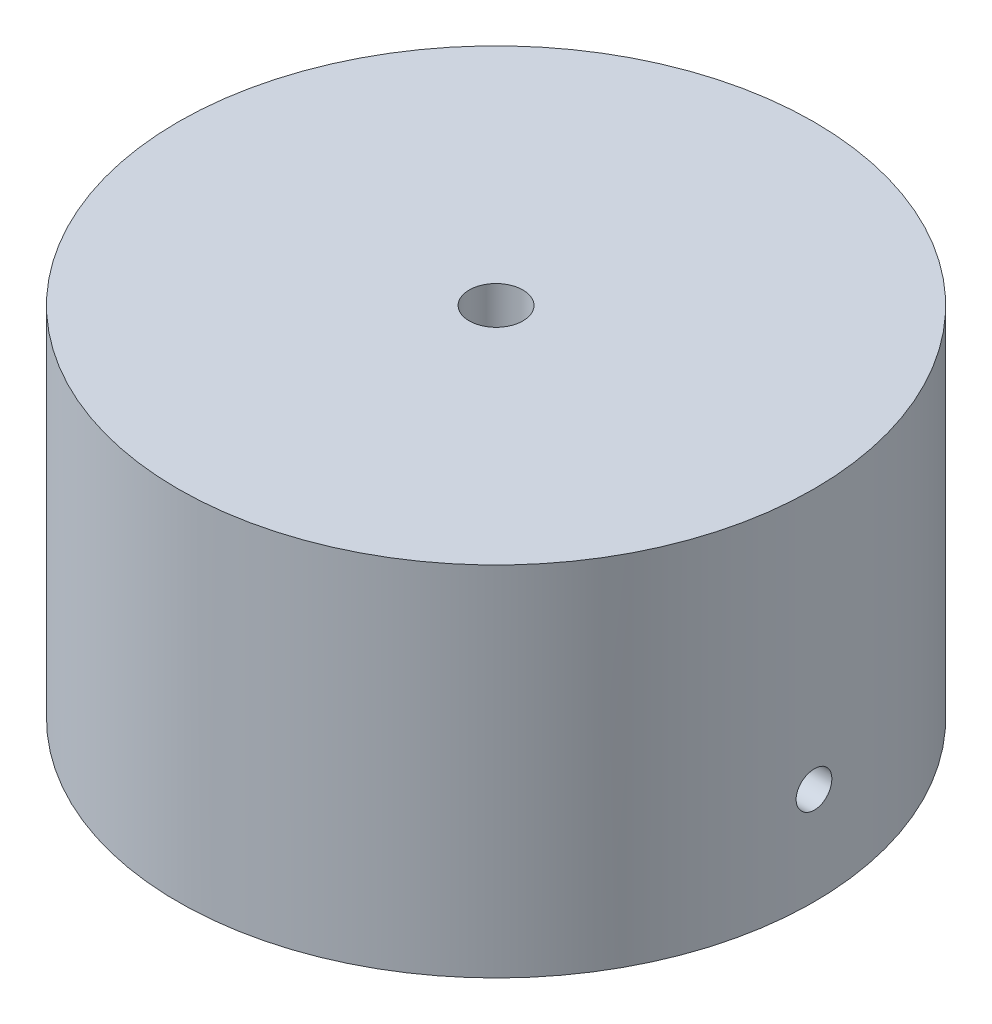
ISO-10303-21;
HEADER;
FILE_DESCRIPTION(('STEP AP214'),'2;1');
FILE_NAME('part.step','',(''),(''),'','','');
FILE_SCHEMA(('AUTOMOTIVE_DESIGN { 1 0 10303 214 1 1 1 1 }'));
ENDSEC;
DATA;
#1=APPLICATION_CONTEXT('core data for automotive mechanical design processes');
#2=APPLICATION_PROTOCOL_DEFINITION('international standard','automotive_design',2000,#1);
#3=PRODUCT_CONTEXT('',#1,'mechanical');
#4=PRODUCT('Part','Part','',(#3));
#5=PRODUCT_RELATED_PRODUCT_CATEGORY('part','',(#4));
#6=PRODUCT_DEFINITION_FORMATION('','',#4);
#7=PRODUCT_DEFINITION_CONTEXT('part definition',#1,'design');
#8=PRODUCT_DEFINITION('design','',#6,#7);
#9=PRODUCT_DEFINITION_SHAPE('','',#8);
#10=(LENGTH_UNIT() NAMED_UNIT(*) SI_UNIT(.MILLI.,.METRE.));
#11=(NAMED_UNIT(*) PLANE_ANGLE_UNIT() SI_UNIT($,.RADIAN.));
#12=(NAMED_UNIT(*) SI_UNIT($,.STERADIAN.) SOLID_ANGLE_UNIT());
#13=UNCERTAINTY_MEASURE_WITH_UNIT(LENGTH_MEASURE(1.E-05),#10,'distance_accuracy_value','');
#14=(GEOMETRIC_REPRESENTATION_CONTEXT(3) GLOBAL_UNCERTAINTY_ASSIGNED_CONTEXT((#13)) GLOBAL_UNIT_ASSIGNED_CONTEXT((#10,
#11,#12)) REPRESENTATION_CONTEXT('',''));
#15=CARTESIAN_POINT('',(0.,0.,0.));
#16=DIRECTION('',(0.,0.,1.));
#17=DIRECTION('',(1.,0.,0.));
#18=AXIS2_PLACEMENT_3D('',#15,#16,#17);
#19=CARTESIAN_POINT('',(0.,15.,0.));
#20=DIRECTION('',(0.,-1.,0.));
#21=DIRECTION('',(0.,0.,-1.));
#22=AXIS2_PLACEMENT_3D('',#19,#20,#21);
#23=CYLINDRICAL_SURFACE('',#22,40.);
#24=CARTESIAN_POINT('',(39.9331462603372,-17.7607744903535,-2.31167250070583));
#25=CARTESIAN_POINT('',(39.9331471180368,-17.88705066871,-2.31166693668305));
#26=CARTESIAN_POINT('',(39.9337680814845,-18.0134158639392,-2.30100728626743));
#27=CARTESIAN_POINT('',(39.9361865639679,-18.2626587273926,-2.25863579684835));
#28=CARTESIAN_POINT('',(39.9379854613057,-18.3855321339147,-2.22689929516899));
#29=CARTESIAN_POINT('',(39.9425595639835,-18.6241449172329,-2.14328679615643));
#30=CARTESIAN_POINT('',(39.9453342632227,-18.7398879557026,-2.09142123734084));
#31=CARTESIAN_POINT('',(39.951553428363,-18.9609936076964,-1.96903898394872));
#32=CARTESIAN_POINT('',(39.9549977383551,-19.0663586290036,-1.89852662963352));
#33=CARTESIAN_POINT('',(39.9621820697692,-19.2638792481319,-1.74075509657997));
#34=CARTESIAN_POINT('',(39.9659224104298,-19.3560202756141,-1.65347768969516));
#35=CARTESIAN_POINT('',(39.9732859252847,-19.524352885688,-1.46469014940566));
#36=CARTESIAN_POINT('',(39.9769090946421,-19.6005438105596,-1.36317942936274));
#37=CARTESIAN_POINT('',(39.9836457179169,-19.7348559201043,-1.14872702787129));
#38=CARTESIAN_POINT('',(39.986758841089,-19.7929654014439,-1.03577800532557));
#39=CARTESIAN_POINT('',(39.9921361941393,-19.8893900922993,-0.801706402045541));
#40=CARTESIAN_POINT('',(39.9944004316979,-19.9277054809094,-0.68058389527502));
#41=CARTESIAN_POINT('',(39.9978384490474,-19.9834148916998,-0.433740510207968));
#42=CARTESIAN_POINT('',(39.9990133916024,-20.0008312283601,-0.308024684428757));
#43=CARTESIAN_POINT('',(40.0001608993962,-20.0143170367639,-0.055448503803109));
#44=CARTESIAN_POINT('',(40.0001334760298,-20.01038671081,0.071411840185341));
#45=CARTESIAN_POINT('',(39.9988966051234,-19.9813092237063,0.32252480933423));
#46=CARTESIAN_POINT('',(39.9976884950058,-19.9561860731272,0.446780222566951));
#47=CARTESIAN_POINT('',(39.9942442317903,-19.8854733301443,0.689308961316965));
#48=CARTESIAN_POINT('',(39.9920080735435,-19.8398836352381,0.807582256870736));
#49=CARTESIAN_POINT('',(39.9867727579982,-19.729504639315,1.03486631002225));
#50=CARTESIAN_POINT('',(39.9837731671859,-19.6647044261868,1.143871757817));
#51=CARTESIAN_POINT('',(39.9773627661262,-19.5177517871914,1.34946742137305));
#52=CARTESIAN_POINT('',(39.9739519521607,-19.4355992044268,1.44605752486402));
#53=CARTESIAN_POINT('',(39.967110051053,-19.2561381609326,1.62422029101025));
#54=CARTESIAN_POINT('',(39.9636789423736,-19.1588088648055,1.70577196708459));
#55=CARTESIAN_POINT('',(39.9571985852586,-18.9518303165005,1.8513807185656));
#56=CARTESIAN_POINT('',(39.9541493369463,-18.8421810603423,1.91543778832035));
#57=CARTESIAN_POINT('',(39.9487852985056,-18.6136621456595,2.02423689926823));
#58=CARTESIAN_POINT('',(39.9464705400906,-18.4947920892792,2.06897810648027));
#59=CARTESIAN_POINT('',(39.9428435487463,-18.2512117643225,2.13786090145891));
#60=CARTESIAN_POINT('',(39.9415313062717,-18.1265015513639,2.16200268535825));
#61=CARTESIAN_POINT('',(39.9400622694232,-17.8749639098895,2.18897511244405));
#62=CARTESIAN_POINT('',(39.9399038945037,-17.7481396161229,2.19183490740389));
#63=CARTESIAN_POINT('',(39.9407566980432,-17.4958130845734,2.1762382747062));
#64=CARTESIAN_POINT('',(39.9417678715883,-17.3703108412383,2.15778193660899));
#65=CARTESIAN_POINT('',(39.9448419610509,-17.1242730966179,2.10010127685794));
#66=CARTESIAN_POINT('',(39.9469041992291,-17.0037344488118,2.0608903373941));
#67=CARTESIAN_POINT('',(39.9518423238625,-16.7709485245811,1.962827353883));
#68=CARTESIAN_POINT('',(39.9547182162906,-16.6587013090303,1.90397516565175));
#69=CARTESIAN_POINT('',(39.9609557065957,-16.4455505283434,1.76822600235195));
#70=CARTESIAN_POINT('',(39.9643178293858,-16.3446594348279,1.69130946908073));
#71=CARTESIAN_POINT('',(39.9711369463509,-16.1572103644781,1.52164397105696));
#72=CARTESIAN_POINT('',(39.9745939412842,-16.070652502257,1.42889487971417));
#73=CARTESIAN_POINT('',(39.9812056855747,-15.9142287600984,1.2300722129001));
#74=CARTESIAN_POINT('',(39.9843600913268,-15.8443817248103,1.12398379846414));
#75=CARTESIAN_POINT('',(39.9899928915252,-15.7234912213345,0.901569207459459));
#76=CARTESIAN_POINT('',(39.9924712894957,-15.6724476551198,0.785243084266203));
#77=CARTESIAN_POINT('',(39.9964562156366,-15.5906459006804,0.545725209038883));
#78=CARTESIAN_POINT('',(39.9979633184533,-15.5598757178926,0.422537563440028));
#79=CARTESIAN_POINT('',(39.999821956635,-15.5194549156088,0.17273639167832));
#80=CARTESIAN_POINT('',(40.0001735008088,-15.5098041351198,0.0461228916381806));
#81=CARTESIAN_POINT('',(39.9996652444468,-15.5118976163931,-0.206749045833869));
#82=CARTESIAN_POINT('',(39.9988071160066,-15.5236123517891,-0.333007732134464));
#83=CARTESIAN_POINT('',(39.9959627035904,-15.568043201984,-0.581760823511321));
#84=CARTESIAN_POINT('',(39.9939764175509,-15.6007593551968,-0.704255221701875));
#85=CARTESIAN_POINT('',(39.9890831458684,-15.6862579824789,-0.942008084865708));
#86=CARTESIAN_POINT('',(39.9861761590794,-15.7390404815241,-1.05726654083247));
#87=CARTESIAN_POINT('',(39.9797531913367,-15.8631689574699,-1.27728762038803));
#88=CARTESIAN_POINT('',(39.9762372277066,-15.9345144063393,-1.38205054240949));
#89=CARTESIAN_POINT('',(39.9689726699293,-16.0938512402957,-1.5782559426512));
#90=CARTESIAN_POINT('',(39.9652237860897,-16.1818636449458,-1.66968133964176));
#91=CARTESIAN_POINT('',(39.9579065676513,-16.3720139095798,-1.8364895732873));
#92=CARTESIAN_POINT('',(39.9543382775875,-16.47415523084,-1.91186846737543));
#93=CARTESIAN_POINT('',(39.9477720360971,-16.6897613659352,-2.04448938516729));
#94=CARTESIAN_POINT('',(39.9447747116212,-16.8032384210334,-2.1017115171338));
#95=CARTESIAN_POINT('',(39.9396903418463,-17.0381226290089,-2.19622324302328));
#96=CARTESIAN_POINT('',(39.9376022261497,-17.1595202623561,-2.2335362873468));
#97=CARTESIAN_POINT('',(39.9351174112175,-17.3615180382141,-2.27742571455761));
#98=CARTESIAN_POINT('',(39.9343814473962,-17.4408110284466,-2.29025176729771));
#99=CARTESIAN_POINT('',(39.933395599694,-17.6003155267699,-2.30737692360751));
#100=CARTESIAN_POINT('',(39.9331457152762,-17.680527033846,-2.31167603659583));
#101=CARTESIAN_POINT('',(39.9331462603372,-17.7607744903535,-2.31167250070583));
#102=B_SPLINE_CURVE_WITH_KNOTS('',3,(#24,#25,#26,#27,#28,#29,#30,#31,#32,#33,#34,#35,#36,#37,
#38,#39,#40,#41,#42,#43,#44,#45,#46,#47,#48,#49,#50,#51,#52,#53,#54,#55,#56,#57,#58,#59,#60,#61,
#62,#63,#64,#65,#66,#67,#68,#69,#70,#71,#72,#73,#74,#75,#76,#77,#78,#79,#80,#81,#82,#83,#84,#85,
#86,#87,#88,#89,#90,#91,#92,#93,#94,#95,#96,#97,#98,#99,#100,#101),.UNSPECIFIED.,.T.,.F.,(4,2,2,
2,2,2,2,2,2,2,2,2,2,2,2,2,2,2,2,2,2,2,2,2,2,2,2,2,2,2,2,2,2,2,2,2,2,2,4),(0.,0.37853559199898,
0.757514902471093,1.13629794405891,1.51499289691526,1.89410194833275,2.27322662965086,
2.65259619391327,3.0319623256306,3.41092303647406,3.78988015590868,4.16840850875616,
4.54693875740705,4.92568443515113,5.30443353760182,5.68370726068127,6.06298110629121,
6.44227132577977,6.82155793390199,7.20032490469013,7.57909028408444,7.95761173941129,
8.33613597347885,8.71507193924755,9.09401093496518,9.47337526357915,9.85273761445105,
10.2318753170064,10.6110101293874,10.9896213882004,11.368233339535,11.746845762115,
12.125447416076,12.5045297629984,12.8837051418376,13.2632945053591,13.6424357677973,
13.8829922401581,14.1235484468061),.UNSPECIFIED.);
#103=CARTESIAN_POINT('',(39.9331462603372,-17.7607744903535,-2.31167250070583));
#104=VERTEX_POINT('',#103);
#105=EDGE_CURVE('E57',#104,#104,#102,.T.);
#106=ORIENTED_EDGE('',*,*,#105,.T.);
#107=EDGE_LOOP('',(#106));
#108=FACE_BOUND('',#107,.T.);
#109=CARTESIAN_POINT('',(0.,15.,0.));
#110=DIRECTION('',(0.,1.,0.));
#111=DIRECTION('',(0.,0.,1.));
#112=AXIS2_PLACEMENT_3D('',#109,#110,#111);
#113=CIRCLE('',#112,40.);
#114=CARTESIAN_POINT('',(0.,15.,40.));
#115=VERTEX_POINT('',#114);
#116=EDGE_CURVE('E11',#115,#115,#113,.T.);
#117=ORIENTED_EDGE('',*,*,#116,.F.);
#118=EDGE_LOOP('',(#117));
#119=FACE_BOUND('',#118,.T.);
#120=CARTESIAN_POINT('',(0.,-30.,0.));
#121=DIRECTION('',(0.,-1.,0.));
#122=DIRECTION('',(0.,0.,-1.));
#123=AXIS2_PLACEMENT_3D('',#120,#121,#122);
#124=CIRCLE('',#123,40.);
#125=CARTESIAN_POINT('',(0.,-30.,-40.));
#126=VERTEX_POINT('',#125);
#127=EDGE_CURVE('E40',#126,#126,#124,.T.);
#128=ORIENTED_EDGE('',*,*,#127,.F.);
#129=EDGE_LOOP('',(#128));
#130=FACE_BOUND('',#129,.T.);
#131=ADVANCED_FACE('F33',(#108,#119,#130),#23,.T.);
#132=CARTESIAN_POINT('',(0.,15.,0.));
#133=DIRECTION('',(0.,1.,0.));
#134=DIRECTION('',(0.,0.,1.));
#135=AXIS2_PLACEMENT_3D('',#132,#133,#134);
#136=PLANE('',#135);
#137=CARTESIAN_POINT('',(0.,15.,0.));
#138=DIRECTION('',(0.,1.,0.));
#139=DIRECTION('',(0.,0.,1.));
#140=AXIS2_PLACEMENT_3D('',#137,#138,#139);
#141=CIRCLE('',#140,3.37819999999999);
#142=CARTESIAN_POINT('',(0.,15.,3.37819999999999));
#143=VERTEX_POINT('',#142);
#144=EDGE_CURVE('E54',#143,#143,#141,.T.);
#145=ORIENTED_EDGE('',*,*,#144,.F.);
#146=EDGE_LOOP('',(#145));
#147=FACE_BOUND('',#146,.T.);
#148=ORIENTED_EDGE('',*,*,#116,.T.);
#149=EDGE_LOOP('',(#148));
#150=FACE_BOUND('',#149,.T.);
#151=ADVANCED_FACE('F84',(#147,#150),#136,.T.);
#152=CARTESIAN_POINT('',(0.,-30.,0.));
#153=DIRECTION('',(0.,-1.,0.));
#154=DIRECTION('',(0.,0.,-1.));
#155=AXIS2_PLACEMENT_3D('',#152,#153,#154);
#156=PLANE('',#155);
#157=ORIENTED_EDGE('',*,*,#127,.T.);
#158=EDGE_LOOP('',(#157));
#159=FACE_BOUND('',#158,.T.);
#160=CARTESIAN_POINT('',(0.,-30.,0.));
#161=DIRECTION('',(0.,-1.,0.));
#162=DIRECTION('',(0.,0.,-1.));
#163=AXIS2_PLACEMENT_3D('',#160,#161,#162);
#164=CIRCLE('',#163,35.1);
#165=CARTESIAN_POINT('',(0.,-30.,-35.1));
#166=VERTEX_POINT('',#165);
#167=EDGE_CURVE('E100',#166,#166,#164,.T.);
#168=ORIENTED_EDGE('',*,*,#167,.F.);
#169=EDGE_LOOP('',(#168));
#170=FACE_BOUND('',#169,.T.);
#171=ADVANCED_FACE('F89',(#159,#170),#156,.T.);
#172=CARTESIAN_POINT('',(0.,-30.,0.));
#173=DIRECTION('',(0.,1.,0.));
#174=DIRECTION('',(0.,0.,1.));
#175=AXIS2_PLACEMENT_3D('',#172,#173,#174);
#176=CYLINDRICAL_SURFACE('',#175,35.1);
#177=CARTESIAN_POINT('',(35.0242938795632,-17.7607744903535,-2.30409162968719));
#178=CARTESIAN_POINT('',(35.0242948532785,-17.8870185984349,-2.30408607869201));
#179=CARTESIAN_POINT('',(35.0250001790539,-18.0133509393944,-2.29343195010005));
#180=CARTESIAN_POINT('',(35.0277469348576,-18.2625267970903,-2.25108363542928));
#181=CARTESIAN_POINT('',(35.0297899172629,-18.3853660870333,-2.21936500296518));
#182=CARTESIAN_POINT('',(35.0349837904128,-18.6239104596366,-2.13580265196841));
#183=CARTESIAN_POINT('',(35.0381340933714,-18.7396192890523,-2.08396960901821));
#184=CARTESIAN_POINT('',(35.0451936403578,-18.9606632843127,-1.96166677813416));
#185=CARTESIAN_POINT('',(35.0491027113209,-19.0660008074703,-1.8912012386962));
#186=CARTESIAN_POINT('',(35.0572554584586,-19.2635079333263,-1.73351173354182));
#187=CARTESIAN_POINT('',(35.0614995918751,-19.3556590418416,-1.64626462544626));
#188=CARTESIAN_POINT('',(35.0698516153331,-19.5240191853222,-1.45753592622107));
#189=CARTESIAN_POINT('',(35.0739594996681,-19.6002275532666,-1.35605373981318));
#190=CARTESIAN_POINT('',(35.0815931888612,-19.7345958852978,-1.14163057681164));
#191=CARTESIAN_POINT('',(35.0851184987641,-19.7927405389806,-1.02867998684163));
#192=CARTESIAN_POINT('',(35.0911999769761,-19.8892328990207,-0.794593222238926));
#193=CARTESIAN_POINT('',(35.0937561560976,-19.9275808262476,-0.673457138947779));
#194=CARTESIAN_POINT('',(35.0976239366519,-19.9833398380365,-0.426615916377728));
#195=CARTESIAN_POINT('',(35.0989372600107,-20.0007798985638,-0.300917349851445));
#196=CARTESIAN_POINT('',(35.1001937760004,-20.0143176053444,-0.0483701951414919));
#197=CARTESIAN_POINT('',(35.1001369847465,-20.0104155026219,0.0784783794983911));
#198=CARTESIAN_POINT('',(35.09867732455,-19.9814035392746,0.329528468682785));
#199=CARTESIAN_POINT('',(35.0972764335481,-19.9563248480454,0.453733598750852));
#200=CARTESIAN_POINT('',(35.0933050071867,-19.8857199750954,0.696169446557339));
#201=CARTESIAN_POINT('',(35.0907344646261,-19.8401936674859,0.814400127508182));
#202=CARTESIAN_POINT('',(35.0847252776073,-19.7299506296169,1.04163058221621));
#203=CARTESIAN_POINT('',(35.0812859949531,-19.6652197851443,1.15062349073948));
#204=CARTESIAN_POINT('',(35.073940401027,-19.5184154126292,1.35620903993571));
#205=CARTESIAN_POINT('',(35.0700340842177,-19.4363416789491,1.45280153355305));
#206=CARTESIAN_POINT('',(35.0621982287756,-19.2570052861439,1.63102577851069));
#207=CARTESIAN_POINT('',(35.0582686610112,-19.1597155710001,1.71263030618819));
#208=CARTESIAN_POINT('',(35.050846919864,-18.9528036717799,1.85835169924694));
#209=CARTESIAN_POINT('',(35.047354746665,-18.8431814825191,1.92246855727627));
#210=CARTESIAN_POINT('',(35.0412105472256,-18.6146989835834,2.03139221997481));
#211=CARTESIAN_POINT('',(35.0385585716535,-18.4958381173045,2.07619786013163));
#212=CARTESIAN_POINT('',(35.0344014971336,-18.252260302637,2.14520797466106));
#213=CARTESIAN_POINT('',(35.0328963839894,-18.1275434267564,2.16941270403875));
#214=CARTESIAN_POINT('',(35.0312086084531,-17.8760313669964,2.1964997543784));
#215=CARTESIAN_POINT('',(35.0310235983022,-17.7492402749108,2.1994199294041));
#216=CARTESIAN_POINT('',(35.0319911393328,-17.4969701381735,2.18395387400315));
#217=CARTESIAN_POINT('',(35.0331436831879,-17.3714910863387,2.16556776028463));
#218=CARTESIAN_POINT('',(35.0366519072917,-17.1255140659202,2.10804264827033));
#219=CARTESIAN_POINT('',(35.0390065758748,-17.0050120009024,2.06892109912725));
#220=CARTESIAN_POINT('',(35.0446477540279,-16.7722830982661,1.9710536269027));
#221=CARTESIAN_POINT('',(35.0479342724873,-16.6600563396028,1.91230751661165));
#222=CARTESIAN_POINT('',(35.0550668329916,-16.4468899376904,1.77676228011632));
#223=CARTESIAN_POINT('',(35.0589136579151,-16.3459664426003,1.69993780021655));
#224=CARTESIAN_POINT('',(35.0667205202638,-16.1584341230195,1.53045399030721));
#225=CARTESIAN_POINT('',(35.0706805588531,-16.0718254457635,1.43779449744682));
#226=CARTESIAN_POINT('',(35.078262343348,-15.9152533256368,1.23910850221079));
#227=CARTESIAN_POINT('',(35.0818835866277,-15.8453143828182,1.13306267113296));
#228=CARTESIAN_POINT('',(35.0883592909521,-15.7242347250438,0.910711902319718));
#229=CARTESIAN_POINT('',(35.0912137569253,-15.6730938892622,0.794407030530757));
#230=CARTESIAN_POINT('',(35.0958170229585,-15.5911047252046,0.554929965997466));
#231=CARTESIAN_POINT('',(35.0975666665491,-15.5602409147134,0.431763090766901));
#232=CARTESIAN_POINT('',(35.0997503315025,-15.519631248327,0.181984639064885));
#233=CARTESIAN_POINT('',(35.1001843666063,-15.5098851718646,0.0553730985857217));
#234=CARTESIAN_POINT('',(35.0996718433075,-15.511789794304,-0.197458128090426));
#235=CARTESIAN_POINT('',(35.0987277588184,-15.5234021615946,-0.323678109849445));
#236=CARTESIAN_POINT('',(35.0955533302558,-15.5676145331734,-0.572370096855508));
#237=CARTESIAN_POINT('',(35.0933229839483,-15.6002145739128,-0.694842095592693));
#238=CARTESIAN_POINT('',(35.0878107940973,-15.6854681681359,-0.932567388168945));
#239=CARTESIAN_POINT('',(35.084528960727,-15.7381215276033,-1.0478207518359));
#240=CARTESIAN_POINT('',(35.0772672282058,-15.8619818813285,-1.26785529416495));
#241=CARTESIAN_POINT('',(35.0732873466861,-15.9331884069939,-1.37263673722113));
#242=CARTESIAN_POINT('',(35.065055080877,-16.0922756914844,-1.56894814218278));
#243=CARTESIAN_POINT('',(35.060802250641,-16.1801842223928,-1.66045557868707));
#244=CARTESIAN_POINT('',(35.0524956223801,-16.3701416598761,-1.82744656739595));
#245=CARTESIAN_POINT('',(35.0484418732835,-16.4721940192702,-1.90292619543269));
#246=CARTESIAN_POINT('',(35.0409767722445,-16.6876642092947,-2.03577841106466));
#247=CARTESIAN_POINT('',(35.0375662507933,-16.8010964474199,-2.09312765365821));
#248=CARTESIAN_POINT('',(35.0317766838616,-17.0359198017269,-2.18789801633625));
#249=CARTESIAN_POINT('',(35.0293964323671,-17.1573014197594,-2.22534244838657));
#250=CARTESIAN_POINT('',(35.0265549095658,-17.3596490282618,-2.26952142185264));
#251=CARTESIAN_POINT('',(35.0257107557186,-17.4393074473393,-2.28246845887131));
#252=CARTESIAN_POINT('',(35.0245799301919,-17.5995567456997,-2.29975532904753));
#253=CARTESIAN_POINT('',(35.0242932576916,-17.6801476236097,-2.30409517487718));
#254=CARTESIAN_POINT('',(35.0242938795632,-17.7607744903535,-2.30409162968719));
#255=B_SPLINE_CURVE_WITH_KNOTS('',3,(#177,#178,#179,#180,#181,#182,#183,#184,#185,#186,#187,
#188,#189,#190,#191,#192,#193,#194,#195,#196,#197,#198,#199,#200,#201,#202,#203,#204,#205,#206,
#207,#208,#209,#210,#211,#212,#213,#214,#215,#216,#217,#218,#219,#220,#221,#222,#223,#224,#225,
#226,#227,#228,#229,#230,#231,#232,#233,#234,#235,#236,#237,#238,#239,#240,#241,#242,#243,#244,
#245,#246,#247,#248,#249,#250,#251,#252,#253,#254),.UNSPECIFIED.,.T.,.F.,(4,2,2,2,2,2,2,2,2,2,2,
2,2,2,2,2,2,2,2,2,2,2,2,2,2,2,2,2,2,2,2,2,2,2,2,2,2,2,4),(0.,0.378437982948397,
0.757315930962597,1.13599306657706,1.51458393232336,1.89370068079818,2.2728332877929,
2.65228636796521,3.03173521453651,3.41065757726029,3.78957548315067,4.16793663758944,
4.54630012149738,4.9249423722397,5.30358911285829,5.68291695672986,6.06224496007283,
6.44159583459753,6.82094201331989,7.19961336907176,7.57828265060926,7.95663378151055,
8.33498852181635,8.71387707516053,9.09276952531419,9.47221545878676,9.85165895330914,
10.2308123917541,10.6099618700575,10.9884315595248,11.3669019063174,11.7453685914943,
12.1238257187642,12.5029177408592,12.8821024711906,13.2617734763705,13.6409988361585,
13.8826918086708,14.1243844253455),.UNSPECIFIED.);
#256=CARTESIAN_POINT('',(35.0242938795632,-17.7607744903535,-2.30409162968719));
#257=VERTEX_POINT('',#256);
#258=EDGE_CURVE('E53',#257,#257,#255,.T.);
#259=ORIENTED_EDGE('',*,*,#258,.F.);
#260=EDGE_LOOP('',(#259));
#261=FACE_BOUND('',#260,.T.);
#262=ORIENTED_EDGE('',*,*,#167,.T.);
#263=EDGE_LOOP('',(#262));
#264=FACE_BOUND('',#263,.T.);
#265=CARTESIAN_POINT('',(0.,0.,0.));
#266=DIRECTION('',(0.,-1.,0.));
#267=DIRECTION('',(0.,0.,-1.));
#268=AXIS2_PLACEMENT_3D('',#265,#266,#267);
#269=CIRCLE('',#268,35.1);
#270=CARTESIAN_POINT('',(0.,0.,-35.1));
#271=VERTEX_POINT('',#270);
#272=EDGE_CURVE('E102',#271,#271,#269,.T.);
#273=ORIENTED_EDGE('',*,*,#272,.F.);
#274=EDGE_LOOP('',(#273));
#275=FACE_BOUND('',#274,.T.);
#276=ADVANCED_FACE('F108',(#261,#264,#275),#176,.F.);
#277=CARTESIAN_POINT('',(0.,0.,0.));
#278=DIRECTION('',(0.,1.,0.));
#279=DIRECTION('',(0.,0.,1.));
#280=AXIS2_PLACEMENT_3D('',#277,#278,#279);
#281=PLANE('',#280);
#282=ORIENTED_EDGE('',*,*,#272,.T.);
#283=EDGE_LOOP('',(#282));
#284=FACE_BOUND('',#283,.T.);
#285=ADVANCED_FACE('F75',(#284),#281,.F.);
#286=CARTESIAN_POINT('',(39.999952301196,-17.7607744903535,-0.0617729879869275));
#287=DIRECTION('',(0.9999988075299,0.,-0.00154432469967309));
#288=DIRECTION('',(-0.00154432469967309,0.,-0.9999988075299));
#289=AXIS2_PLACEMENT_3D('',#286,#287,#288);
#290=CYLINDRICAL_SURFACE('',#289,2.24999999999999);
#291=ORIENTED_EDGE('',*,*,#258,.T.);
#292=EDGE_LOOP('',(#291));
#293=FACE_BOUND('',#292,.T.);
#294=ORIENTED_EDGE('',*,*,#105,.F.);
#295=EDGE_LOOP('',(#294));
#296=FACE_BOUND('',#295,.T.);
#297=ADVANCED_FACE('F47',(#293,#296),#290,.F.);
#298=CARTESIAN_POINT('',(0.,5.,0.));
#299=DIRECTION('',(0.,1.,0.));
#300=DIRECTION('',(0.,0.,1.));
#301=AXIS2_PLACEMENT_3D('',#298,#299,#300);
#302=CONICAL_SURFACE('',#301,3.37819999999999,1.02974425867665);
#303=CARTESIAN_POINT('',(0.,2.97017265680109,0.));
#304=VERTEX_POINT('',#303);
#305=VERTEX_LOOP('',#304);
#306=FACE_BOUND('',#305,.T.);
#307=CARTESIAN_POINT('',(0.,5.,0.));
#308=DIRECTION('',(0.,1.,0.));
#309=DIRECTION('',(0.,0.,1.));
#310=AXIS2_PLACEMENT_3D('',#307,#308,#309);
#311=CIRCLE('',#310,3.37819999999999);
#312=CARTESIAN_POINT('',(0.,5.,3.37819999999999));
#313=VERTEX_POINT('',#312);
#314=EDGE_CURVE('E51',#313,#313,#311,.T.);
#315=ORIENTED_EDGE('',*,*,#314,.T.);
#316=EDGE_LOOP('',(#315));
#317=FACE_BOUND('',#316,.T.);
#318=ADVANCED_FACE('F43',(#306,#317),#302,.F.);
#319=CARTESIAN_POINT('',(0.,15.,0.));
#320=DIRECTION('',(0.,1.,0.));
#321=DIRECTION('',(0.,0.,1.));
#322=AXIS2_PLACEMENT_3D('',#319,#320,#321);
#323=CYLINDRICAL_SURFACE('',#322,3.37819999999999);
#324=ORIENTED_EDGE('',*,*,#314,.F.);
#325=EDGE_LOOP('',(#324));
#326=FACE_BOUND('',#325,.T.);
#327=ORIENTED_EDGE('',*,*,#144,.T.);
#328=EDGE_LOOP('',(#327));
#329=FACE_BOUND('',#328,.T.);
#330=ADVANCED_FACE('F46',(#326,#329),#323,.F.);
#331=CLOSED_SHELL('',(#131,#151,#171,#276,#285,#297,#318,#330));
#332=MANIFOLD_SOLID_BREP('B2',#331);
#333=ADVANCED_BREP_SHAPE_REPRESENTATION('',(#18,#332),#14);
#334=SHAPE_DEFINITION_REPRESENTATION(#9,#333);
ENDSEC;
END-ISO-10303-21;
